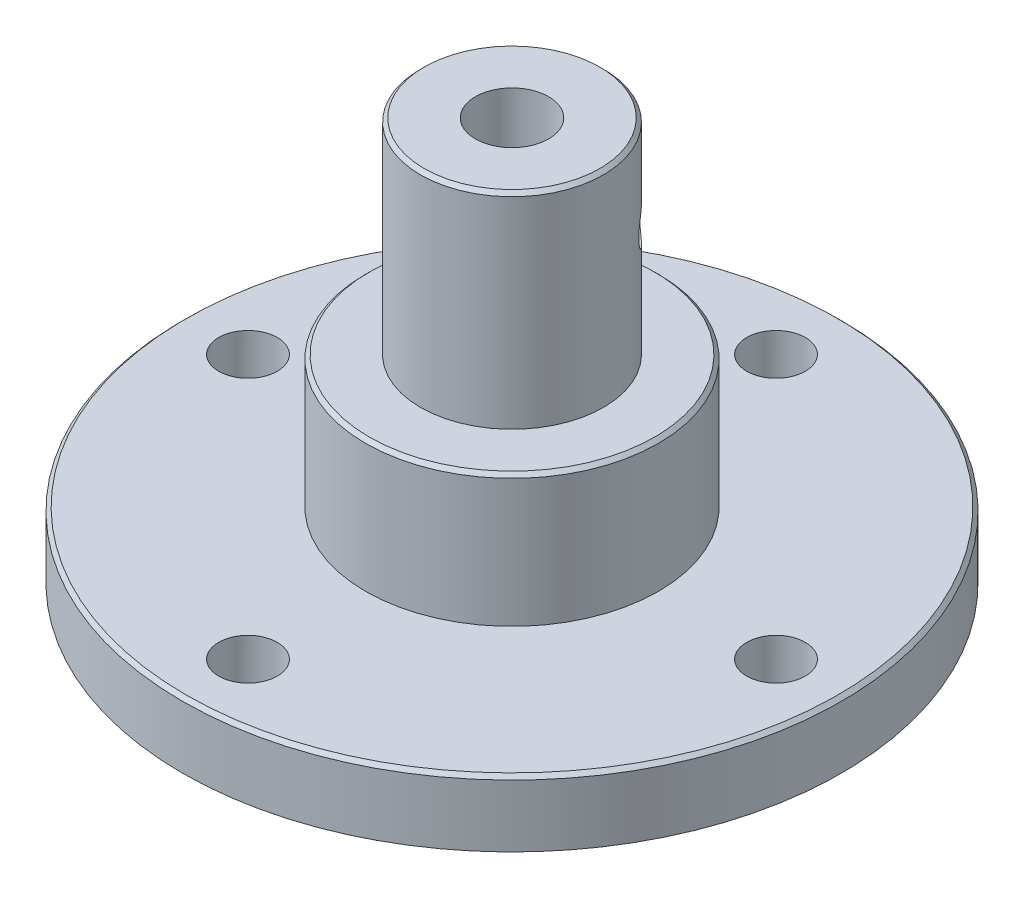
ISO-10303-21;
HEADER;
FILE_DESCRIPTION(('STEP AP214'),'2;1');
FILE_NAME('part.step','',(''),(''),'','','');
FILE_SCHEMA(('AUTOMOTIVE_DESIGN { 1 0 10303 214 1 1 1 1 }'));
ENDSEC;
DATA;
#1=APPLICATION_CONTEXT('core data for automotive mechanical design processes');
#2=APPLICATION_PROTOCOL_DEFINITION('international standard','automotive_design',2000,#1);
#3=PRODUCT_CONTEXT('',#1,'mechanical');
#4=PRODUCT('Part','Part','',(#3));
#5=PRODUCT_RELATED_PRODUCT_CATEGORY('part','',(#4));
#6=PRODUCT_DEFINITION_FORMATION('','',#4);
#7=PRODUCT_DEFINITION_CONTEXT('part definition',#1,'design');
#8=PRODUCT_DEFINITION('design','',#6,#7);
#9=PRODUCT_DEFINITION_SHAPE('','',#8);
#10=(LENGTH_UNIT() NAMED_UNIT(*) SI_UNIT(.MILLI.,.METRE.));
#11=(NAMED_UNIT(*) PLANE_ANGLE_UNIT() SI_UNIT($,.RADIAN.));
#12=(NAMED_UNIT(*) SI_UNIT($,.STERADIAN.) SOLID_ANGLE_UNIT());
#13=UNCERTAINTY_MEASURE_WITH_UNIT(LENGTH_MEASURE(1.E-05),#10,'distance_accuracy_value','');
#14=(GEOMETRIC_REPRESENTATION_CONTEXT(3) GLOBAL_UNCERTAINTY_ASSIGNED_CONTEXT((#13)) GLOBAL_UNIT_ASSIGNED_CONTEXT((#10,
#11,#12)) REPRESENTATION_CONTEXT('',''));
#15=CARTESIAN_POINT('',(0.,0.,0.));
#16=DIRECTION('',(0.,0.,1.));
#17=DIRECTION('',(1.,0.,0.));
#18=AXIS2_PLACEMENT_3D('',#15,#16,#17);
#19=CARTESIAN_POINT('',(0.,55.,0.));
#20=DIRECTION('',(0.,-1.,0.));
#21=DIRECTION('',(0.,0.,-1.));
#22=AXIS2_PLACEMENT_3D('',#19,#20,#21);
#23=CYLINDRICAL_SURFACE('',#22,12.5);
#24=CARTESIAN_POINT('',(0.,54.5,0.));
#25=DIRECTION('',(0.,1.,0.));
#26=DIRECTION('',(0.,0.,1.));
#27=AXIS2_PLACEMENT_3D('',#24,#25,#26);
#28=CIRCLE('',#27,12.5);
#29=CARTESIAN_POINT('',(0.,54.5,12.5));
#30=VERTEX_POINT('',#29);
#31=EDGE_CURVE('E91',#30,#30,#28,.F.);
#32=ORIENTED_EDGE('',*,*,#31,.T.);
#33=EDGE_LOOP('',(#32));
#34=FACE_BOUND('',#33,.T.);
#35=CARTESIAN_POINT('',(0.,27.,0.));
#36=DIRECTION('',(0.,1.,0.));
#37=DIRECTION('',(0.,0.,1.));
#38=AXIS2_PLACEMENT_3D('',#35,#36,#37);
#39=CIRCLE('',#38,12.5);
#40=CARTESIAN_POINT('',(0.,27.,12.5));
#41=VERTEX_POINT('',#40);
#42=EDGE_CURVE('E81',#41,#41,#39,.T.);
#43=ORIENTED_EDGE('',*,*,#42,.T.);
#44=EDGE_LOOP('',(#43));
#45=FACE_BOUND('',#44,.T.);
#46=CARTESIAN_POINT('',(6.89248708487804,42.5,-10.4280209908108));
#47=CARTESIAN_POINT('',(6.89249266894419,42.6389109387279,-10.4280193124493));
#48=CARTESIAN_POINT('',(6.90239086736106,42.7778865583333,-10.4214957543482));
#49=CARTESIAN_POINT('',(6.9415471148444,43.0519062628578,-10.3954536165737));
#50=CARTESIAN_POINT('',(6.97082065483876,43.18694711159,-10.3759246387602));
#51=CARTESIAN_POINT('',(7.04736728006833,43.4490932583855,-10.3240851933959));
#52=CARTESIAN_POINT('',(7.09462246162393,43.5762063038315,-10.2917874380196));
#53=CARTESIAN_POINT('',(7.20511561262486,43.8191871117424,-10.2147356951889));
#54=CARTESIAN_POINT('',(7.26835269001746,43.9350555013447,-10.1699824029442));
#55=CARTESIAN_POINT('',(7.40919552888463,44.1539025096346,-10.0678430474093));
#56=CARTESIAN_POINT('',(7.48697338779624,44.2566989697099,-10.0103039331337));
#57=CARTESIAN_POINT('',(7.65340194931341,44.4448938339475,-9.88364073999078));
#58=CARTESIAN_POINT('',(7.74205341338491,44.530291018543,-9.81451584966061));
#59=CARTESIAN_POINT('',(7.92784542513855,44.6819700440712,-9.66507015907381));
#60=CARTESIAN_POINT('',(8.02505323015998,44.7480787845416,-9.58465702483716));
#61=CARTESIAN_POINT('',(8.22385200903225,44.8581873426203,-9.41463450238528));
#62=CARTESIAN_POINT('',(8.32544257162586,44.9021892297525,-9.325025975939));
#63=CARTESIAN_POINT('',(8.52821412897214,44.9662679840491,-9.1399207971933));
#64=CARTESIAN_POINT('',(8.62938288379007,44.9866524439275,-9.04451728194198));
#65=CARTESIAN_POINT('',(8.82944905969022,45.0038773795958,-8.84931369890389));
#66=CARTESIAN_POINT('',(8.92834669871981,45.0007201241146,-8.74951405569602));
#67=CARTESIAN_POINT('',(9.11963809195134,44.9711845494611,-8.54991508465251));
#68=CARTESIAN_POINT('',(9.21210441019315,44.9451375570804,-8.4501359917287));
#69=CARTESIAN_POINT('',(9.38976534290421,44.8710874188528,-8.25227226851863));
#70=CARTESIAN_POINT('',(9.47495966626416,44.8230833945203,-8.15418770619231));
#71=CARTESIAN_POINT('',(9.63679137373862,44.7061748996318,-7.96229370308219));
#72=CARTESIAN_POINT('',(9.71337144912159,44.6371406222378,-7.86851509921393));
#73=CARTESIAN_POINT('',(9.85602508867526,44.4802273069085,-7.68907851792081));
#74=CARTESIAN_POINT('',(9.92209744237426,44.3923461005737,-7.60342147654445));
#75=CARTESIAN_POINT('',(10.0438526858066,44.1984159447288,-7.44187144819737));
#76=CARTESIAN_POINT('',(10.0993344165823,44.092077033176,-7.36617466920849));
#77=CARTESIAN_POINT('',(10.1977776954074,43.8652088938731,-7.22927804473266));
#78=CARTESIAN_POINT('',(10.2407390066539,43.744679397792,-7.16807847344058));
#79=CARTESIAN_POINT('',(10.3137592594942,43.4924479204455,-7.06261374912719));
#80=CARTESIAN_POINT('',(10.3437903918742,43.3607225809008,-7.01838511786659));
#81=CARTESIAN_POINT('',(10.3905012319661,43.09007169069,-6.94904667543429));
#82=CARTESIAN_POINT('',(10.4071826797892,42.9511470809523,-6.92393437249881));
#83=CARTESIAN_POINT('',(10.4268565859614,42.6725878550024,-6.89427129396551));
#84=CARTESIAN_POINT('',(10.4300783956011,42.5330060642241,-6.88937603796905));
#85=CARTESIAN_POINT('',(10.423430099385,42.2548794420008,-6.89943041917338));
#86=CARTESIAN_POINT('',(10.4135607359071,42.1163345522028,-6.9143789310683));
#87=CARTESIAN_POINT('',(10.3809896349199,41.8455783992694,-6.96318120133366));
#88=CARTESIAN_POINT('',(10.3584118532134,41.7133191424106,-6.99685230472543));
#89=CARTESIAN_POINT('',(10.3007354827077,41.4573418024281,-7.08148677963126));
#90=CARTESIAN_POINT('',(10.2656358624707,41.3336244239107,-7.13245157562892));
#91=CARTESIAN_POINT('',(10.182723379081,41.0964672251246,-7.25033691255671));
#92=CARTESIAN_POINT('',(10.1347507709718,40.9831823842479,-7.31745676678468));
#93=CARTESIAN_POINT('',(10.0268321585059,40.7717292199977,-7.46464639146849));
#94=CARTESIAN_POINT('',(9.96688492175428,40.6735624543768,-7.54471749466874));
#95=CARTESIAN_POINT('',(9.83476944397018,40.4935936020361,-7.71616342348921));
#96=CARTESIAN_POINT('',(9.76242772475892,40.412065863375,-7.80769290379637));
#97=CARTESIAN_POINT('',(9.60735230788145,40.269635296251,-7.99773722304657));
#98=CARTESIAN_POINT('',(9.52461904682998,40.208731601638,-8.09625176842692));
#99=CARTESIAN_POINT('',(9.35091375548407,40.1096778206334,-8.29625451320012));
#100=CARTESIAN_POINT('',(9.25999192108258,40.0713987044344,-8.39772231779567));
#101=CARTESIAN_POINT('',(9.07168823470576,40.0182718808404,-8.60079240177223));
#102=CARTESIAN_POINT('',(8.97430716226295,40.0034213513108,-8.70239466348108));
#103=CARTESIAN_POINT('',(8.7775153674555,39.9976825475928,-8.90080966624973));
#104=CARTESIAN_POINT('',(8.67816945043675,40.0063817988594,-8.99767498533575));
#105=CARTESIAN_POINT('',(8.47879261644075,40.0465848763696,-9.18579697786155));
#106=CARTESIAN_POINT('',(8.3787617080923,40.0780884158703,-9.27705372180828));
#107=CARTESIAN_POINT('',(8.18140618404558,40.162822480229,-9.45155646156881));
#108=CARTESIAN_POINT('',(8.08407593256686,40.2160034453274,-9.53482019834666));
#109=CARTESIAN_POINT('',(7.89506995244134,40.3425306033278,-9.69190330812367));
#110=CARTESIAN_POINT('',(7.80339467133726,40.4158783897612,-9.76572193411815));
#111=CARTESIAN_POINT('',(7.6274054645277,40.5820484676532,-9.9038080788029));
#112=CARTESIAN_POINT('',(7.54323415429535,40.6751658409594,-9.96790230329841));
#113=CARTESIAN_POINT('',(7.38702011227376,40.8776256002469,-10.0842174736057));
#114=CARTESIAN_POINT('',(7.31498025771056,40.9869718236998,-10.1364356037822));
#115=CARTESIAN_POINT('',(7.18516162627678,41.2201982917261,-10.2288752574959));
#116=CARTESIAN_POINT('',(7.12754482132181,41.3442224028031,-10.2689615007345));
#117=CARTESIAN_POINT('',(7.0301056852486,41.6023319331503,-10.3359149142919));
#118=CARTESIAN_POINT('',(6.99026721367361,41.736408096718,-10.362794077203));
#119=CARTESIAN_POINT('',(6.93782710041183,41.9756561386072,-10.3979450270686));
#120=CARTESIAN_POINT('',(6.92086763765162,42.0794635487849,-10.4092159493028));
#121=CARTESIAN_POINT('',(6.89819570122619,42.2888348863778,-10.4242544397882));
#122=CARTESIAN_POINT('',(6.89248283982467,42.3943987531112,-10.4280222667151));
#123=CARTESIAN_POINT('',(6.89248708487804,42.5,-10.4280209908108));
#124=B_SPLINE_CURVE_WITH_KNOTS('',3,(#46,#47,#48,#49,#50,#51,#52,#53,#54,#55,#56,#57,#58,#59,
#60,#61,#62,#63,#64,#65,#66,#67,#68,#69,#70,#71,#72,#73,#74,#75,#76,#77,#78,#79,#80,#81,#82,#83,
#84,#85,#86,#87,#88,#89,#90,#91,#92,#93,#94,#95,#96,#97,#98,#99,#100,#101,#102,#103,#104,#105,
#106,#107,#108,#109,#110,#111,#112,#113,#114,#115,#116,#117,#118,#119,#120,#121,#122,#123),
.UNSPECIFIED.,.T.,.F.,(4,2,2,2,2,2,2,2,2,2,2,2,2,2,2,2,2,2,2,2,2,2,2,2,2,2,2,2,2,2,2,2,2,2,2,2,
2,2,4),(0.,0.416346159673581,0.833025598210747,1.24929124485146,1.66553366214966,
2.08705631371092,2.50860850088556,2.93383501093626,3.35902170616401,3.77860622207702,
4.19815030290622,4.61171974083845,5.02530572684377,5.44149810555759,5.85773839425166,
6.28123366906209,6.70473695306802,7.12914657931942,7.55350087540063,7.97059394511485,
8.38766336321055,8.80073354458299,9.21383775885998,9.63232649436305,10.0508583217552,
10.4758150433363,10.9007539157526,11.3232453394663,11.7456858672907,12.1607754353672,
12.5758597841689,12.9900004268863,13.4041738033671,13.8250288006399,14.2459834722445,
14.6714724644902,15.096574377255,15.413095090954,15.729604892137),.UNSPECIFIED.);
#125=CARTESIAN_POINT('',(6.89248708487804,42.5,-10.4280209908108));
#126=VERTEX_POINT('',#125);
#127=EDGE_CURVE('E133',#126,#126,#124,.T.);
#128=ORIENTED_EDGE('',*,*,#127,.F.);
#129=EDGE_LOOP('',(#128));
#130=FACE_BOUND('',#129,.T.);
#131=ADVANCED_FACE('F39',(#34,#45,#130),#23,.T.);
#132=CARTESIAN_POINT('',(0.,15.,0.));
#133=DIRECTION('',(0.,1.,0.));
#134=DIRECTION('',(0.,0.,1.));
#135=AXIS2_PLACEMENT_3D('',#132,#133,#134);
#136=CYLINDRICAL_SURFACE('',#135,5.);
#137=CARTESIAN_POINT('',(0.,15.,0.));
#138=DIRECTION('',(0.,1.,0.));
#139=DIRECTION('',(0.,0.,1.));
#140=AXIS2_PLACEMENT_3D('',#137,#138,#139);
#141=CIRCLE('',#140,5.);
#142=CARTESIAN_POINT('',(0.,15.,5.));
#143=VERTEX_POINT('',#142);
#144=EDGE_CURVE('E64',#143,#143,#141,.T.);
#145=ORIENTED_EDGE('',*,*,#144,.F.);
#146=EDGE_LOOP('',(#145));
#147=FACE_BOUND('',#146,.T.);
#148=CARTESIAN_POINT('',(0.,55.,0.));
#149=DIRECTION('',(0.,1.,0.));
#150=DIRECTION('',(0.,0.,1.));
#151=AXIS2_PLACEMENT_3D('',#148,#149,#150);
#152=CIRCLE('',#151,5.);
#153=CARTESIAN_POINT('',(0.,55.,5.));
#154=VERTEX_POINT('',#153);
#155=EDGE_CURVE('E60',#154,#154,#152,.T.);
#156=ORIENTED_EDGE('',*,*,#155,.T.);
#157=EDGE_LOOP('',(#156));
#158=FACE_BOUND('',#157,.T.);
#159=CARTESIAN_POINT('',(1.29409522551261,42.5,-4.82962913144535));
#160=CARTESIAN_POINT('',(1.29411171484918,42.6302665068765,-4.82963074942732));
#161=CARTESIAN_POINT('',(1.30556368829184,42.7607027206762,-4.8266012619293));
#162=CARTESIAN_POINT('',(1.35039743224143,43.0175689715292,-4.81424260020802));
#163=CARTESIAN_POINT('',(1.38382528327676,43.1439900040573,-4.80490018746051));
#164=CARTESIAN_POINT('',(1.46971013009742,43.3886289455611,-4.77932309413757));
#165=CARTESIAN_POINT('',(1.52206591490862,43.5068865735622,-4.76312499491625));
#166=CARTESIAN_POINT('',(1.64253675141718,43.7335605630945,-4.72293266688146));
#167=CARTESIAN_POINT('',(1.71065265565166,43.8419763917958,-4.69893801628837));
#168=CARTESIAN_POINT('',(1.8655282782389,44.0557643039169,-4.63974342560432));
#169=CARTESIAN_POINT('',(1.95336233412378,44.1601478344898,-4.6037825224641));
#170=CARTESIAN_POINT('',(2.13982182504955,44.3535209757132,-4.52013349226784));
#171=CARTESIAN_POINT('',(2.2384526031239,44.4425029077549,-4.47243954411996));
#172=CARTESIAN_POINT('',(2.44963922621228,44.6084178764856,-4.36055840255424));
#173=CARTESIAN_POINT('',(2.56268556935651,44.6841344192791,-4.29547615340789));
#174=CARTESIAN_POINT('',(2.79192368160103,44.8128521334839,-4.15012387458966));
#175=CARTESIAN_POINT('',(2.90811341623266,44.8658676404385,-4.06986347611965));
#176=CARTESIAN_POINT('',(3.13029042370992,44.943761653164,-3.90119571591882));
#177=CARTESIAN_POINT('',(3.23641538385685,44.9703738158651,-3.81377440101393));
#178=CARTESIAN_POINT('',(3.44273535053229,45.0004152967113,-3.62860059076536));
#179=CARTESIAN_POINT('',(3.54293390865979,45.0038586419954,-3.53085438286004));
#180=CARTESIAN_POINT('',(3.72550228562018,44.9881333150686,-3.33718567154215));
#181=CARTESIAN_POINT('',(3.80866478624991,44.9709049611955,-3.24184375071957));
#182=CARTESIAN_POINT('',(3.96520066734352,44.9177978902398,-3.04838803445195));
#183=CARTESIAN_POINT('',(4.03857331477599,44.8819177775598,-2.95027403210851));
#184=CARTESIAN_POINT('',(4.17551013384906,44.7922935847751,-2.75313163927946));
#185=CARTESIAN_POINT('',(4.23892455603287,44.7383092170697,-2.65410937874445));
#186=CARTESIAN_POINT('',(4.35463448894977,44.6143414594964,-2.45967033440608));
#187=CARTESIAN_POINT('',(4.40692600598147,44.5443523417442,-2.36425485570218));
#188=CARTESIAN_POINT('',(4.50536197767373,44.3827616211674,-2.17129561576438));
#189=CARTESIAN_POINT('',(4.55045811944352,44.289742429185,-2.07440325169715));
#190=CARTESIAN_POINT('',(4.62915900016494,44.0885256876746,-1.89228675224642));
#191=CARTESIAN_POINT('',(4.66275491271003,43.9803165693148,-1.80707160905512));
#192=CARTESIAN_POINT('',(4.72161165511156,43.7433795189398,-1.64744606309462));
#193=CARTESIAN_POINT('',(4.7462076915382,43.6137849423645,-1.57406545344335));
#194=CARTESIAN_POINT('',(4.78547527723542,43.3426558216025,-1.45033856910516));
#195=CARTESIAN_POINT('',(4.80015718791982,43.2011339174561,-1.39996826384708));
#196=CARTESIAN_POINT('',(4.82004034210367,42.921963721793,-1.3298312347588));
#197=CARTESIAN_POINT('',(4.82590068649888,42.7848972023911,-1.30795562998884));
#198=CARTESIAN_POINT('',(4.83076992919297,42.5089966462086,-1.28987280708203));
#199=CARTESIAN_POINT('',(4.82978366722691,42.3701639272005,-1.29364745723076));
#200=CARTESIAN_POINT('',(4.82137118698888,42.1108652035532,-1.32460072155672));
#201=CARTESIAN_POINT('',(4.81466124396506,41.9900513722303,-1.34917398379596));
#202=CARTESIAN_POINT('',(4.7953091603682,41.7540805343225,-1.41641254227623));
#203=CARTESIAN_POINT('',(4.78266509856914,41.6389253731331,-1.45908369744681));
#204=CARTESIAN_POINT('',(4.75000714335632,41.4114716727436,-1.5622015226413));
#205=CARTESIAN_POINT('',(4.72967903736139,41.2995524578674,-1.62337993562479));
#206=CARTESIAN_POINT('',(4.68077864870919,41.0863268211512,-1.75941271784743));
#207=CARTESIAN_POINT('',(4.65220212827675,40.9850258912119,-1.83427410969994));
#208=CARTESIAN_POINT('',(4.58155193232079,40.7825530811967,-2.00472341578637));
#209=CARTESIAN_POINT('',(4.53823095068596,40.6830071232278,-2.10173447430748));
#210=CARTESIAN_POINT('',(4.43841530017113,40.5014694049941,-2.30505824769389));
#211=CARTESIAN_POINT('',(4.38191619478212,40.4194835743414,-2.41137408753243));
#212=CARTESIAN_POINT('',(4.2531570964185,40.2735656852091,-2.63198977503957));
#213=CARTESIAN_POINT('',(4.18052049774462,40.2101672047915,-2.74642628330505));
#214=CARTESIAN_POINT('',(4.02053122449974,40.107155240038,-2.97570188428666));
#215=CARTESIAN_POINT('',(3.93319155858659,40.0675208703949,-3.09054053401683));
#216=CARTESIAN_POINT('',(3.75412671146039,40.0165785906436,-3.30518573943065));
#217=CARTESIAN_POINT('',(3.66353918857194,40.0030053141696,-3.4054047540823));
#218=CARTESIAN_POINT('',(3.47418411602748,39.9978918325054,-3.59837322957278));
#219=CARTESIAN_POINT('',(3.37541944162465,40.0063439143389,-3.69112529350803));
#220=CARTESIAN_POINT('',(3.17986219184547,40.0435410303955,-3.86058679451914));
#221=CARTESIAN_POINT('',(3.08336851029004,40.0709121716363,-3.93795061500097));
#222=CARTESIAN_POINT('',(2.88937086800108,40.1433174497583,-4.08242246375702));
#223=CARTESIAN_POINT('',(2.79186676433975,40.1883541196336,-4.14952901936194));
#224=CARTESIAN_POINT('',(2.59479177901623,40.2968178187393,-4.27566738878125));
#225=CARTESIAN_POINT('',(2.49531086520822,40.3609490246898,-4.33423108454434));
#226=CARTESIAN_POINT('',(2.30182124961528,40.5048941101476,-4.44002235913974));
#227=CARTESIAN_POINT('',(2.20781508699274,40.5847151926269,-4.48724470913456));
#228=CARTESIAN_POINT('',(2.0194473368458,40.7669957944494,-4.57533489347623));
#229=CARTESIAN_POINT('',(1.92598143983509,40.8709177260007,-4.61510262221047));
#230=CARTESIAN_POINT('',(1.75356851603304,41.0936152853822,-4.68333338329781));
#231=CARTESIAN_POINT('',(1.67463434844761,41.2124039141992,-4.7117864288048));
#232=CARTESIAN_POINT('',(1.53364806560014,41.4666361176643,-4.75958790191815));
#233=CARTESIAN_POINT('',(1.47220828529014,41.6024873884246,-4.77862019078944));
#234=CARTESIAN_POINT('',(1.39919009437015,41.8132226495198,-4.80030175500081));
#235=CARTESIAN_POINT('',(1.37805144249246,41.8845597756976,-4.80638205865771));
#236=CARTESIAN_POINT('',(1.34260123058454,42.0290406968493,-4.81640594850289));
#237=CARTESIAN_POINT('',(1.32828489750758,42.1021831909544,-4.82035102880427));
#238=CARTESIAN_POINT('',(1.30979236990679,42.2295009865469,-4.82540235718875));
#239=CARTESIAN_POINT('',(1.30391637410235,42.2834163215122,-4.82698914906814));
#240=CARTESIAN_POINT('',(1.29606423841546,42.3915446163104,-4.82910223480861));
#241=CARTESIAN_POINT('',(1.29408835942493,42.4457575958105,-4.82962845772473));
#242=CARTESIAN_POINT('',(1.29409522551261,42.5,-4.82962913144535));
#243=B_SPLINE_CURVE_WITH_KNOTS('',3,(#159,#160,#161,#162,#163,#164,#165,#166,#167,#168,#169,
#170,#171,#172,#173,#174,#175,#176,#177,#178,#179,#180,#181,#182,#183,#184,#185,#186,#187,#188,
#189,#190,#191,#192,#193,#194,#195,#196,#197,#198,#199,#200,#201,#202,#203,#204,#205,#206,#207,
#208,#209,#210,#211,#212,#213,#214,#215,#216,#217,#218,#219,#220,#221,#222,#223,#224,#225,#226,
#227,#228,#229,#230,#231,#232,#233,#234,#235,#236,#237,#238,#239,#240,#241,#242),.UNSPECIFIED.,
.T.,.F.,(4,2,2,2,2,2,2,2,2,2,2,2,2,2,2,2,2,2,2,2,2,2,2,2,2,2,2,2,2,2,2,2,2,2,2,2,2,2,2,2,2,4),
(0.,0.390580306486788,0.781982232062014,1.17132148982692,1.56068181366371,1.98215578129642,
2.40383927716011,2.85394730601992,3.30377067414811,3.72158712424922,4.13915059220184,
4.5204024371643,4.90168281298722,5.2882383683295,5.67493248380764,6.09817978647311,
6.5217512061988,6.97222104328705,7.42221935534346,7.83655727140614,8.25060232976016,
8.61935458565147,8.98822631095241,9.37418241020303,9.76033715555202,10.1951685895662,
10.6301466245059,11.076604535375,11.5226694952701,11.927806759788,12.3328021699001,
12.7111106218382,13.0894733378512,13.4840187680376,13.8787457525688,14.3127560463025,
14.7471485711797,15.195268726016,15.4189244153949,15.6424233996907,15.8050484542806,
15.9676843870379),.UNSPECIFIED.);
#244=CARTESIAN_POINT('',(1.29409522551261,42.5,-4.82962913144535));
#245=VERTEX_POINT('',#244);
#246=EDGE_CURVE('E142',#245,#245,#243,.T.);
#247=ORIENTED_EDGE('',*,*,#246,.T.);
#248=EDGE_LOOP('',(#247));
#249=FACE_BOUND('',#248,.T.);
#250=ADVANCED_FACE('F115',(#147,#158,#249),#136,.F.);
#251=CARTESIAN_POINT('',(0.,9.,0.));
#252=DIRECTION('',(0.,-1.,0.));
#253=DIRECTION('',(0.,0.,-1.));
#254=AXIS2_PLACEMENT_3D('',#251,#252,#253);
#255=CYLINDRICAL_SURFACE('',#254,45.);
#256=CARTESIAN_POINT('',(0.,8.50000000000003,0.));
#257=DIRECTION('',(0.,1.,0.));
#258=DIRECTION('',(0.,0.,1.));
#259=AXIS2_PLACEMENT_3D('',#256,#257,#258);
#260=CIRCLE('',#259,45.);
#261=CARTESIAN_POINT('',(0.,8.50000000000003,45.));
#262=VERTEX_POINT('',#261);
#263=EDGE_CURVE('E11',#262,#262,#260,.F.);
#264=ORIENTED_EDGE('',*,*,#263,.T.);
#265=EDGE_LOOP('',(#264));
#266=FACE_BOUND('',#265,.T.);
#267=CARTESIAN_POINT('',(0.,0.,0.));
#268=DIRECTION('',(0.,1.,0.));
#269=DIRECTION('',(0.,0.,1.));
#270=AXIS2_PLACEMENT_3D('',#267,#268,#269);
#271=CIRCLE('',#270,45.);
#272=CARTESIAN_POINT('',(0.,0.,45.));
#273=VERTEX_POINT('',#272);
#274=EDGE_CURVE('E76',#273,#273,#271,.T.);
#275=ORIENTED_EDGE('',*,*,#274,.T.);
#276=EDGE_LOOP('',(#275));
#277=FACE_BOUND('',#276,.T.);
#278=ADVANCED_FACE('F121',(#266,#277),#255,.T.);
#279=CARTESIAN_POINT('',(0.,9.,0.));
#280=DIRECTION('',(0.,1.,0.));
#281=DIRECTION('',(0.,0.,1.));
#282=AXIS2_PLACEMENT_3D('',#279,#280,#281);
#283=PLANE('',#282);
#284=CARTESIAN_POINT('',(0.,9.,0.));
#285=DIRECTION('',(0.,1.,0.));
#286=DIRECTION('',(0.,0.,1.));
#287=AXIS2_PLACEMENT_3D('',#284,#285,#286);
#288=CIRCLE('',#287,44.5);
#289=CARTESIAN_POINT('',(0.,9.,44.5));
#290=VERTEX_POINT('',#289);
#291=EDGE_CURVE('E47',#290,#290,#288,.T.);
#292=ORIENTED_EDGE('',*,*,#291,.T.);
#293=EDGE_LOOP('',(#292));
#294=FACE_BOUND('',#293,.T.);
#295=CARTESIAN_POINT('',(36.05,9.,0.));
#296=DIRECTION('',(0.,1.,0.));
#297=DIRECTION('',(0.,0.,1.));
#298=AXIS2_PLACEMENT_3D('',#295,#296,#297);
#299=CIRCLE('',#298,4.);
#300=CARTESIAN_POINT('',(36.05,9.,4.));
#301=VERTEX_POINT('',#300);
#302=EDGE_CURVE('E196',#301,#301,#299,.F.);
#303=ORIENTED_EDGE('',*,*,#302,.T.);
#304=EDGE_LOOP('',(#303));
#305=FACE_BOUND('',#304,.T.);
#306=CARTESIAN_POINT('',(0.,9.,36.05));
#307=DIRECTION('',(0.,1.,0.));
#308=DIRECTION('',(0.,0.,1.));
#309=AXIS2_PLACEMENT_3D('',#306,#307,#308);
#310=CIRCLE('',#309,4.);
#311=CARTESIAN_POINT('',(0.,9.,40.05));
#312=VERTEX_POINT('',#311);
#313=EDGE_CURVE('E191',#312,#312,#310,.F.);
#314=ORIENTED_EDGE('',*,*,#313,.T.);
#315=EDGE_LOOP('',(#314));
#316=FACE_BOUND('',#315,.T.);
#317=CARTESIAN_POINT('',(-36.05,9.,0.));
#318=DIRECTION('',(0.,1.,0.));
#319=DIRECTION('',(0.,0.,1.));
#320=AXIS2_PLACEMENT_3D('',#317,#318,#319);
#321=CIRCLE('',#320,4.);
#322=CARTESIAN_POINT('',(-36.05,9.,4.));
#323=VERTEX_POINT('',#322);
#324=EDGE_CURVE('E185',#323,#323,#321,.F.);
#325=ORIENTED_EDGE('',*,*,#324,.T.);
#326=EDGE_LOOP('',(#325));
#327=FACE_BOUND('',#326,.T.);
#328=CARTESIAN_POINT('',(0.,9.,-36.05));
#329=DIRECTION('',(0.,1.,0.));
#330=DIRECTION('',(0.,0.,1.));
#331=AXIS2_PLACEMENT_3D('',#328,#329,#330);
#332=CIRCLE('',#331,4.);
#333=CARTESIAN_POINT('',(0.,9.,-32.05));
#334=VERTEX_POINT('',#333);
#335=EDGE_CURVE('E141',#334,#334,#332,.F.);
#336=ORIENTED_EDGE('',*,*,#335,.T.);
#337=EDGE_LOOP('',(#336));
#338=FACE_BOUND('',#337,.T.);
#339=CARTESIAN_POINT('',(0.,9.,0.));
#340=DIRECTION('',(0.,1.,0.));
#341=DIRECTION('',(0.,0.,1.));
#342=AXIS2_PLACEMENT_3D('',#339,#340,#341);
#343=CIRCLE('',#342,20.);
#344=CARTESIAN_POINT('',(0.,9.,20.));
#345=VERTEX_POINT('',#344);
#346=EDGE_CURVE('E84',#345,#345,#343,.T.);
#347=ORIENTED_EDGE('',*,*,#346,.F.);
#348=EDGE_LOOP('',(#347));
#349=FACE_BOUND('',#348,.T.);
#350=ADVANCED_FACE('F102',(#294,#305,#316,#327,#338,#349),#283,.T.);
#351=CARTESIAN_POINT('',(0.,0.,0.));
#352=DIRECTION('',(0.,1.,0.));
#353=DIRECTION('',(0.,0.,1.));
#354=AXIS2_PLACEMENT_3D('',#351,#352,#353);
#355=PLANE('',#354);
#356=CARTESIAN_POINT('',(36.05,0.,0.));
#357=DIRECTION('',(0.,-1.,0.));
#358=DIRECTION('',(0.,0.,-1.));
#359=AXIS2_PLACEMENT_3D('',#356,#357,#358);
#360=CIRCLE('',#359,4.);
#361=CARTESIAN_POINT('',(36.05,0.,-4.));
#362=VERTEX_POINT('',#361);
#363=EDGE_CURVE('E67',#362,#362,#360,.T.);
#364=ORIENTED_EDGE('',*,*,#363,.F.);
#365=EDGE_LOOP('',(#364));
#366=FACE_BOUND('',#365,.T.);
#367=CARTESIAN_POINT('',(0.,0.,36.05));
#368=DIRECTION('',(0.,-1.,0.));
#369=DIRECTION('',(0.,0.,-1.));
#370=AXIS2_PLACEMENT_3D('',#367,#368,#369);
#371=CIRCLE('',#370,4.);
#372=CARTESIAN_POINT('',(0.,0.,32.05));
#373=VERTEX_POINT('',#372);
#374=EDGE_CURVE('E194',#373,#373,#371,.T.);
#375=ORIENTED_EDGE('',*,*,#374,.F.);
#376=EDGE_LOOP('',(#375));
#377=FACE_BOUND('',#376,.T.);
#378=CARTESIAN_POINT('',(-36.05,0.,0.));
#379=DIRECTION('',(0.,-1.,0.));
#380=DIRECTION('',(0.,0.,-1.));
#381=AXIS2_PLACEMENT_3D('',#378,#379,#380);
#382=CIRCLE('',#381,4.);
#383=CARTESIAN_POINT('',(-36.05,0.,-4.));
#384=VERTEX_POINT('',#383);
#385=EDGE_CURVE('E188',#384,#384,#382,.T.);
#386=ORIENTED_EDGE('',*,*,#385,.F.);
#387=EDGE_LOOP('',(#386));
#388=FACE_BOUND('',#387,.T.);
#389=CARTESIAN_POINT('',(0.,0.,-36.05));
#390=DIRECTION('',(0.,-1.,0.));
#391=DIRECTION('',(0.,0.,-1.));
#392=AXIS2_PLACEMENT_3D('',#389,#390,#391);
#393=CIRCLE('',#392,4.);
#394=CARTESIAN_POINT('',(0.,0.,-40.05));
#395=VERTEX_POINT('',#394);
#396=EDGE_CURVE('E182',#395,#395,#393,.T.);
#397=ORIENTED_EDGE('',*,*,#396,.F.);
#398=EDGE_LOOP('',(#397));
#399=FACE_BOUND('',#398,.T.);
#400=CARTESIAN_POINT('',(0.,0.,0.));
#401=DIRECTION('',(0.,-1.,0.));
#402=DIRECTION('',(0.,0.,-1.));
#403=AXIS2_PLACEMENT_3D('',#400,#401,#402);
#404=CIRCLE('',#403,28.5);
#405=CARTESIAN_POINT('',(0.,0.,-28.5));
#406=VERTEX_POINT('',#405);
#407=EDGE_CURVE('E77',#406,#406,#404,.T.);
#408=ORIENTED_EDGE('',*,*,#407,.F.);
#409=EDGE_LOOP('',(#408));
#410=FACE_BOUND('',#409,.T.);
#411=ORIENTED_EDGE('',*,*,#274,.F.);
#412=EDGE_LOOP('',(#411));
#413=FACE_BOUND('',#412,.T.);
#414=ADVANCED_FACE('F203',(#366,#377,#388,#399,#410,#413),#355,.F.);
#415=CARTESIAN_POINT('',(0.,27.,0.));
#416=DIRECTION('',(0.,-1.,0.));
#417=DIRECTION('',(0.,0.,-1.));
#418=AXIS2_PLACEMENT_3D('',#415,#416,#417);
#419=CYLINDRICAL_SURFACE('',#418,20.);
#420=CARTESIAN_POINT('',(0.,26.5,0.));
#421=DIRECTION('',(0.,1.,0.));
#422=DIRECTION('',(0.,0.,1.));
#423=AXIS2_PLACEMENT_3D('',#420,#421,#422);
#424=CIRCLE('',#423,20.);
#425=CARTESIAN_POINT('',(0.,26.5,20.));
#426=VERTEX_POINT('',#425);
#427=EDGE_CURVE('E97',#426,#426,#424,.F.);
#428=ORIENTED_EDGE('',*,*,#427,.T.);
#429=EDGE_LOOP('',(#428));
#430=FACE_BOUND('',#429,.T.);
#431=ORIENTED_EDGE('',*,*,#346,.T.);
#432=EDGE_LOOP('',(#431));
#433=FACE_BOUND('',#432,.T.);
#434=ADVANCED_FACE('F206',(#430,#433),#419,.T.);
#435=CARTESIAN_POINT('',(0.,27.,0.));
#436=DIRECTION('',(0.,1.,0.));
#437=DIRECTION('',(0.,0.,1.));
#438=AXIS2_PLACEMENT_3D('',#435,#436,#437);
#439=PLANE('',#438);
#440=CARTESIAN_POINT('',(0.,27.,0.));
#441=DIRECTION('',(0.,1.,0.));
#442=DIRECTION('',(0.,0.,1.));
#443=AXIS2_PLACEMENT_3D('',#440,#441,#442);
#444=CIRCLE('',#443,19.5);
#445=CARTESIAN_POINT('',(0.,27.,19.5));
#446=VERTEX_POINT('',#445);
#447=EDGE_CURVE('E94',#446,#446,#444,.T.);
#448=ORIENTED_EDGE('',*,*,#447,.T.);
#449=EDGE_LOOP('',(#448));
#450=FACE_BOUND('',#449,.T.);
#451=ORIENTED_EDGE('',*,*,#42,.F.);
#452=EDGE_LOOP('',(#451));
#453=FACE_BOUND('',#452,.T.);
#454=ADVANCED_FACE('F130',(#450,#453),#439,.T.);
#455=CARTESIAN_POINT('',(0.,55.,0.));
#456=DIRECTION('',(0.,1.,0.));
#457=DIRECTION('',(0.,0.,1.));
#458=AXIS2_PLACEMENT_3D('',#455,#456,#457);
#459=PLANE('',#458);
#460=CARTESIAN_POINT('',(0.,55.,0.));
#461=DIRECTION('',(0.,1.,0.));
#462=DIRECTION('',(0.,0.,1.));
#463=AXIS2_PLACEMENT_3D('',#460,#461,#462);
#464=CIRCLE('',#463,12.);
#465=CARTESIAN_POINT('',(0.,55.,12.));
#466=VERTEX_POINT('',#465);
#467=EDGE_CURVE('E80',#466,#466,#464,.T.);
#468=ORIENTED_EDGE('',*,*,#467,.T.);
#469=EDGE_LOOP('',(#468));
#470=FACE_BOUND('',#469,.T.);
#471=ORIENTED_EDGE('',*,*,#155,.F.);
#472=EDGE_LOOP('',(#471));
#473=FACE_BOUND('',#472,.T.);
#474=ADVANCED_FACE('F128',(#470,#473),#459,.T.);
#475=CARTESIAN_POINT('',(0.,-2.,0.));
#476=DIRECTION('',(0.,1.,0.));
#477=DIRECTION('',(0.,0.,1.));
#478=AXIS2_PLACEMENT_3D('',#475,#476,#477);
#479=CYLINDRICAL_SURFACE('',#478,28.5);
#480=CARTESIAN_POINT('',(0.,-2.,0.));
#481=DIRECTION('',(0.,-1.,0.));
#482=DIRECTION('',(0.,0.,-1.));
#483=AXIS2_PLACEMENT_3D('',#480,#481,#482);
#484=CIRCLE('',#483,28.5);
#485=CARTESIAN_POINT('',(0.,-2.,-28.5));
#486=VERTEX_POINT('',#485);
#487=EDGE_CURVE('E72',#486,#486,#484,.T.);
#488=ORIENTED_EDGE('',*,*,#487,.F.);
#489=EDGE_LOOP('',(#488));
#490=FACE_BOUND('',#489,.T.);
#491=ORIENTED_EDGE('',*,*,#407,.T.);
#492=EDGE_LOOP('',(#491));
#493=FACE_BOUND('',#492,.T.);
#494=ADVANCED_FACE('F244',(#490,#493),#479,.T.);
#495=CARTESIAN_POINT('',(0.,-2.,0.));
#496=DIRECTION('',(0.,-1.,0.));
#497=DIRECTION('',(0.,0.,-1.));
#498=AXIS2_PLACEMENT_3D('',#495,#496,#497);
#499=PLANE('',#498);
#500=CARTESIAN_POINT('',(0.,-2.00000000000001,0.));
#501=DIRECTION('',(0.,-1.,0.));
#502=DIRECTION('',(0.,0.,-1.));
#503=AXIS2_PLACEMENT_3D('',#500,#501,#502);
#504=CIRCLE('',#503,15.);
#505=CARTESIAN_POINT('',(0.,-2.00000000000001,-15.));
#506=VERTEX_POINT('',#505);
#507=EDGE_CURVE('E61',#506,#506,#504,.T.);
#508=ORIENTED_EDGE('',*,*,#507,.F.);
#509=EDGE_LOOP('',(#508));
#510=FACE_BOUND('',#509,.T.);
#511=ORIENTED_EDGE('',*,*,#487,.T.);
#512=EDGE_LOOP('',(#511));
#513=FACE_BOUND('',#512,.T.);
#514=ADVANCED_FACE('F257',(#510,#513),#499,.T.);
#515=CARTESIAN_POINT('',(0.,15.,0.));
#516=DIRECTION('',(0.,1.,0.));
#517=DIRECTION('',(0.,0.,1.));
#518=AXIS2_PLACEMENT_3D('',#515,#516,#517);
#519=PLANE('',#518);
#520=ORIENTED_EDGE('',*,*,#144,.T.);
#521=EDGE_LOOP('',(#520));
#522=FACE_BOUND('',#521,.T.);
#523=ADVANCED_FACE('F54',(#522),#519,.T.);
#524=CARTESIAN_POINT('',(0.,4.,15.));
#525=CARTESIAN_POINT('',(0.,11.2047734256462,8.56020803174397));
#526=CARTESIAN_POINT('',(0.,13.,0.));
#527=B_SPLINE_CURVE_WITH_KNOTS('',2,(#524,#525,#526),.UNSPECIFIED.,.F.,.F.,(3,3),(0.,1.),.UNSPECIFIED.);
#528=CARTESIAN_POINT('',(0.,-2.,0.));
#529=DIRECTION('',(0.,-1.,0.));
#530=AXIS1_PLACEMENT('',#528,#529);
#531=SURFACE_OF_REVOLUTION('',#527,#530);
#532=CARTESIAN_POINT('',(0.,13.,0.));
#533=VERTEX_POINT('',#532);
#534=VERTEX_LOOP('',#533);
#535=FACE_BOUND('',#534,.T.);
#536=CARTESIAN_POINT('',(0.,3.99999999999999,0.));
#537=DIRECTION('',(0.,-1.,0.));
#538=DIRECTION('',(0.,0.,-1.));
#539=AXIS2_PLACEMENT_3D('',#536,#537,#538);
#540=CIRCLE('',#539,15.);
#541=CARTESIAN_POINT('',(0.,3.99999999999999,-15.));
#542=VERTEX_POINT('',#541);
#543=EDGE_CURVE('E58',#542,#542,#540,.T.);
#544=ORIENTED_EDGE('',*,*,#543,.T.);
#545=EDGE_LOOP('',(#544));
#546=FACE_BOUND('',#545,.T.);
#547=ADVANCED_FACE('F50',(#535,#546),#531,.T.);
#548=CARTESIAN_POINT('',(0.,-2.,0.));
#549=DIRECTION('',(0.,-1.,0.));
#550=DIRECTION('',(0.,0.,-1.));
#551=AXIS2_PLACEMENT_3D('',#548,#549,#550);
#552=CYLINDRICAL_SURFACE('',#551,15.);
#553=ORIENTED_EDGE('',*,*,#543,.F.);
#554=EDGE_LOOP('',(#553));
#555=FACE_BOUND('',#554,.T.);
#556=ORIENTED_EDGE('',*,*,#507,.T.);
#557=EDGE_LOOP('',(#556));
#558=FACE_BOUND('',#557,.T.);
#559=ADVANCED_FACE('F53',(#555,#558),#552,.F.);
#560=CARTESIAN_POINT('',(0.,55.001,-36.05));
#561=DIRECTION('',(0.,-1.,0.));
#562=DIRECTION('',(0.,0.,-1.));
#563=AXIS2_PLACEMENT_3D('',#560,#561,#562);
#564=CYLINDRICAL_SURFACE('',#563,4.);
#565=ORIENTED_EDGE('',*,*,#335,.F.);
#566=EDGE_LOOP('',(#565));
#567=FACE_BOUND('',#566,.T.);
#568=ORIENTED_EDGE('',*,*,#396,.T.);
#569=EDGE_LOOP('',(#568));
#570=FACE_BOUND('',#569,.T.);
#571=ADVANCED_FACE('F166',(#567,#570),#564,.F.);
#572=CARTESIAN_POINT('',(-36.05,55.001,0.));
#573=DIRECTION('',(0.,-1.,0.));
#574=DIRECTION('',(0.,0.,-1.));
#575=AXIS2_PLACEMENT_3D('',#572,#573,#574);
#576=CYLINDRICAL_SURFACE('',#575,4.);
#577=ORIENTED_EDGE('',*,*,#324,.F.);
#578=EDGE_LOOP('',(#577));
#579=FACE_BOUND('',#578,.T.);
#580=ORIENTED_EDGE('',*,*,#385,.T.);
#581=EDGE_LOOP('',(#580));
#582=FACE_BOUND('',#581,.T.);
#583=ADVANCED_FACE('F162',(#579,#582),#576,.F.);
#584=CARTESIAN_POINT('',(0.,55.001,36.05));
#585=DIRECTION('',(0.,-1.,0.));
#586=DIRECTION('',(0.,0.,-1.));
#587=AXIS2_PLACEMENT_3D('',#584,#585,#586);
#588=CYLINDRICAL_SURFACE('',#587,4.);
#589=ORIENTED_EDGE('',*,*,#313,.F.);
#590=EDGE_LOOP('',(#589));
#591=FACE_BOUND('',#590,.T.);
#592=ORIENTED_EDGE('',*,*,#374,.T.);
#593=EDGE_LOOP('',(#592));
#594=FACE_BOUND('',#593,.T.);
#595=ADVANCED_FACE('F158',(#591,#594),#588,.F.);
#596=CARTESIAN_POINT('',(36.05,55.001,0.));
#597=DIRECTION('',(0.,-1.,0.));
#598=DIRECTION('',(0.,0.,-1.));
#599=AXIS2_PLACEMENT_3D('',#596,#597,#598);
#600=CYLINDRICAL_SURFACE('',#599,4.);
#601=ORIENTED_EDGE('',*,*,#302,.F.);
#602=EDGE_LOOP('',(#601));
#603=FACE_BOUND('',#602,.T.);
#604=ORIENTED_EDGE('',*,*,#363,.T.);
#605=EDGE_LOOP('',(#604));
#606=FACE_BOUND('',#605,.T.);
#607=ADVANCED_FACE('F151',(#603,#606),#600,.F.);
#608=CARTESIAN_POINT('',(-45.0010000000001,42.5,45.0009999999999));
#609=DIRECTION('',(0.707106781186549,0.,-0.707106781186546));
#610=DIRECTION('',(-0.707106781186546,0.,-0.707106781186549));
#611=AXIS2_PLACEMENT_3D('',#608,#609,#610);
#612=CYLINDRICAL_SURFACE('',#611,2.5);
#613=ORIENTED_EDGE('',*,*,#246,.F.);
#614=EDGE_LOOP('',(#613));
#615=FACE_BOUND('',#614,.T.);
#616=ORIENTED_EDGE('',*,*,#127,.T.);
#617=EDGE_LOOP('',(#616));
#618=FACE_BOUND('',#617,.T.);
#619=ADVANCED_FACE('F148',(#615,#618),#612,.F.);
#620=CARTESIAN_POINT('',(0.,55.,0.));
#621=DIRECTION('',(0.,-1.,0.));
#622=DIRECTION('',(0.,0.,-1.));
#623=AXIS2_PLACEMENT_3D('',#620,#621,#622);
#624=CONICAL_SURFACE('',#623,12.,0.785398163397445);
#625=ORIENTED_EDGE('',*,*,#31,.F.);
#626=EDGE_LOOP('',(#625));
#627=FACE_BOUND('',#626,.T.);
#628=ORIENTED_EDGE('',*,*,#467,.F.);
#629=EDGE_LOOP('',(#628));
#630=FACE_BOUND('',#629,.T.);
#631=ADVANCED_FACE('F111',(#627,#630),#624,.T.);
#632=CARTESIAN_POINT('',(0.,27.,0.));
#633=DIRECTION('',(0.,-1.,0.));
#634=DIRECTION('',(0.,0.,-1.));
#635=AXIS2_PLACEMENT_3D('',#632,#633,#634);
#636=CONICAL_SURFACE('',#635,19.5,0.785398163397448);
#637=ORIENTED_EDGE('',*,*,#427,.F.);
#638=EDGE_LOOP('',(#637));
#639=FACE_BOUND('',#638,.T.);
#640=ORIENTED_EDGE('',*,*,#447,.F.);
#641=EDGE_LOOP('',(#640));
#642=FACE_BOUND('',#641,.T.);
#643=ADVANCED_FACE('F106',(#639,#642),#636,.T.);
#644=CARTESIAN_POINT('',(0.,9.,0.));
#645=DIRECTION('',(0.,-1.,0.));
#646=DIRECTION('',(0.,0.,-1.));
#647=AXIS2_PLACEMENT_3D('',#644,#645,#646);
#648=CONICAL_SURFACE('',#647,44.5,0.785398163397448);
#649=ORIENTED_EDGE('',*,*,#263,.F.);
#650=EDGE_LOOP('',(#649));
#651=FACE_BOUND('',#650,.T.);
#652=ORIENTED_EDGE('',*,*,#291,.F.);
#653=EDGE_LOOP('',(#652));
#654=FACE_BOUND('',#653,.T.);
#655=ADVANCED_FACE('F42',(#651,#654),#648,.T.);
#656=CLOSED_SHELL('',(#131,#250,#278,#350,#414,#434,#454,#474,#494,#514,#523,#547,#559,#571,
#583,#595,#607,#619,#631,#643,#655));
#657=MANIFOLD_SOLID_BREP('B2',#656);
#658=ADVANCED_BREP_SHAPE_REPRESENTATION('',(#18,#657),#14);
#659=SHAPE_DEFINITION_REPRESENTATION(#9,#658);
ENDSEC;
END-ISO-10303-21;
